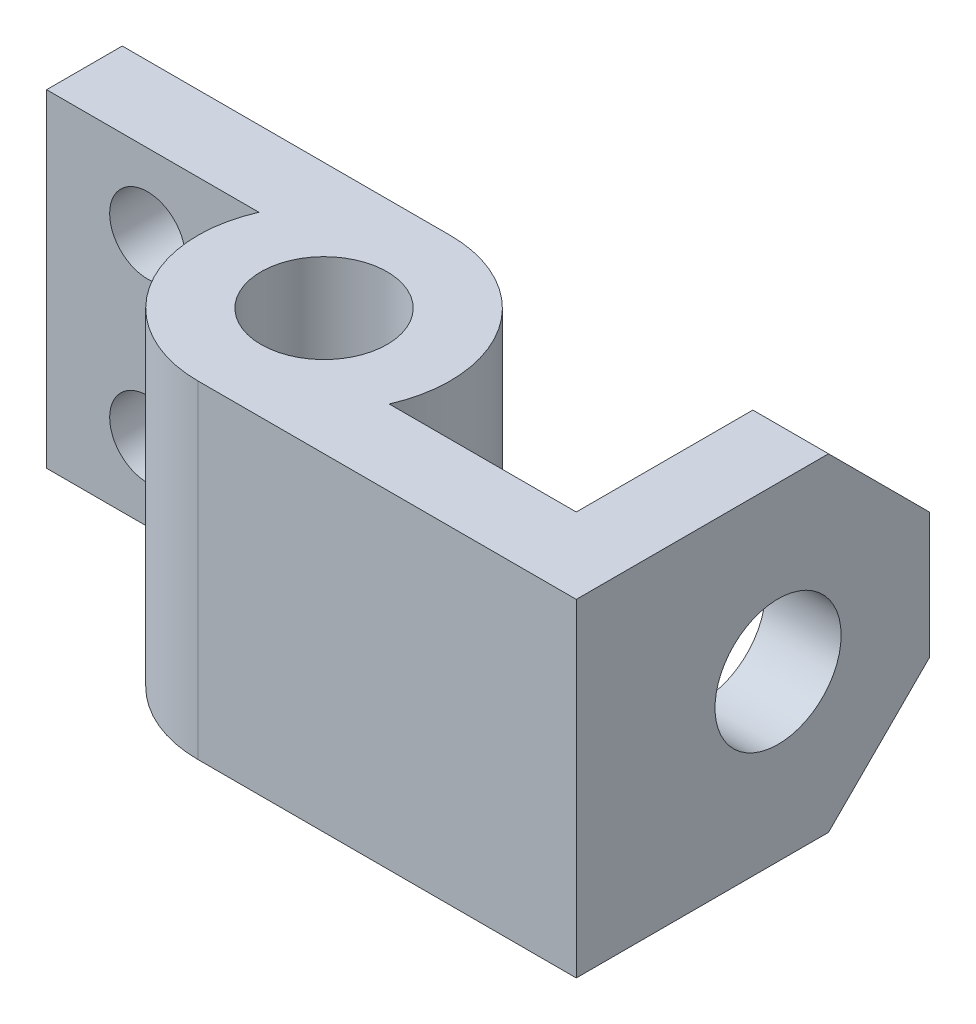
ISO-10303-21;
HEADER;
FILE_DESCRIPTION(('STEP AP214'),'2;1');
FILE_NAME('part.step','',(''),(''),'','','');
FILE_SCHEMA(('AUTOMOTIVE_DESIGN { 1 0 10303 214 1 1 1 1 }'));
ENDSEC;
DATA;
#1=APPLICATION_CONTEXT('core data for automotive mechanical design processes');
#2=APPLICATION_PROTOCOL_DEFINITION('international standard','automotive_design',2000,#1);
#3=PRODUCT_CONTEXT('',#1,'mechanical');
#4=PRODUCT('Part','Part','',(#3));
#5=PRODUCT_RELATED_PRODUCT_CATEGORY('part','',(#4));
#6=PRODUCT_DEFINITION_FORMATION('','',#4);
#7=PRODUCT_DEFINITION_CONTEXT('part definition',#1,'design');
#8=PRODUCT_DEFINITION('design','',#6,#7);
#9=PRODUCT_DEFINITION_SHAPE('','',#8);
#10=(LENGTH_UNIT() NAMED_UNIT(*) SI_UNIT(.MILLI.,.METRE.));
#11=(NAMED_UNIT(*) PLANE_ANGLE_UNIT() SI_UNIT($,.RADIAN.));
#12=(NAMED_UNIT(*) SI_UNIT($,.STERADIAN.) SOLID_ANGLE_UNIT());
#13=UNCERTAINTY_MEASURE_WITH_UNIT(LENGTH_MEASURE(1.E-05),#10,'distance_accuracy_value','');
#14=(GEOMETRIC_REPRESENTATION_CONTEXT(3) GLOBAL_UNCERTAINTY_ASSIGNED_CONTEXT((#13)) GLOBAL_UNIT_ASSIGNED_CONTEXT((#10,
#11,#12)) REPRESENTATION_CONTEXT('',''));
#15=CARTESIAN_POINT('',(0.,0.,0.));
#16=DIRECTION('',(0.,0.,1.));
#17=DIRECTION('',(1.,0.,0.));
#18=AXIS2_PLACEMENT_3D('',#15,#16,#17);
#19=CARTESIAN_POINT('',(0.,82.55,0.));
#20=DIRECTION('',(0.,1.,0.));
#21=DIRECTION('',(0.,0.,1.));
#22=AXIS2_PLACEMENT_3D('',#19,#20,#21);
#23=PLANE('',#22);
#24=DIRECTION('',(0.,0.,-1.));
#25=VECTOR('',#24,1.);
#26=CARTESIAN_POINT('',(95.25,82.55,31.75));
#27=LINE('',#26,#25);
#28=CARTESIAN_POINT('',(95.25,82.55,31.75));
#29=VERTEX_POINT('',#28);
#30=CARTESIAN_POINT('',(95.25,82.55,-31.75));
#31=VERTEX_POINT('',#30);
#32=EDGE_CURVE('E147',#29,#31,#27,.T.);
#33=ORIENTED_EDGE('',*,*,#32,.T.);
#34=DIRECTION('',(-1.,0.,0.));
#35=VECTOR('',#34,1.);
#36=CARTESIAN_POINT('',(76.2,82.55,-31.75));
#37=LINE('',#36,#35);
#38=CARTESIAN_POINT('',(76.2,82.55,-31.75));
#39=VERTEX_POINT('',#38);
#40=EDGE_CURVE('E164',#31,#39,#37,.T.);
#41=ORIENTED_EDGE('',*,*,#40,.T.);
#42=DIRECTION('',(0.,0.,1.));
#43=VECTOR('',#42,1.);
#44=CARTESIAN_POINT('',(76.2,82.55,-57.15));
#45=LINE('',#44,#43);
#46=CARTESIAN_POINT('',(76.2,82.55,12.7));
#47=VERTEX_POINT('',#46);
#48=EDGE_CURVE('E283',#39,#47,#45,.T.);
#49=ORIENTED_EDGE('',*,*,#48,.T.);
#50=DIRECTION('',(-1.,0.,0.));
#51=VECTOR('',#50,1.);
#52=CARTESIAN_POINT('',(76.2,82.55,12.7));
#53=LINE('',#52,#51);
#54=CARTESIAN_POINT('',(29.0993556629696,82.55,12.7));
#55=VERTEX_POINT('',#54);
#56=EDGE_CURVE('E280',#47,#55,#53,.T.);
#57=ORIENTED_EDGE('',*,*,#56,.T.);
#58=CARTESIAN_POINT('',(0.,82.55,0.));
#59=DIRECTION('',(0.,1.,0.));
#60=DIRECTION('',(0.,0.,1.));
#61=AXIS2_PLACEMENT_3D('',#58,#59,#60);
#62=CIRCLE('',#61,31.75);
#63=CARTESIAN_POINT('',(0.,82.55,-31.75));
#64=VERTEX_POINT('',#63);
#65=EDGE_CURVE('E277',#55,#64,#62,.T.);
#66=ORIENTED_EDGE('',*,*,#65,.T.);
#67=DIRECTION('',(-1.,0.,0.));
#68=VECTOR('',#67,1.);
#69=CARTESIAN_POINT('',(0.,82.55,-31.75));
#70=LINE('',#69,#68);
#71=CARTESIAN_POINT('',(-82.55,82.55,-31.75));
#72=VERTEX_POINT('',#71);
#73=EDGE_CURVE('E274',#64,#72,#70,.T.);
#74=ORIENTED_EDGE('',*,*,#73,.T.);
#75=DIRECTION('',(0.,0.,1.));
#76=VECTOR('',#75,1.);
#77=CARTESIAN_POINT('',(-82.55,82.55,-31.75));
#78=LINE('',#77,#76);
#79=CARTESIAN_POINT('',(-82.55,82.55,-12.7));
#80=VERTEX_POINT('',#79);
#81=EDGE_CURVE('E271',#72,#80,#78,.T.);
#82=ORIENTED_EDGE('',*,*,#81,.T.);
#83=DIRECTION('',(1.,0.,0.));
#84=VECTOR('',#83,1.);
#85=CARTESIAN_POINT('',(-82.55,82.55,-12.7));
#86=LINE('',#85,#84);
#87=CARTESIAN_POINT('',(-29.0993556629696,82.55,-12.7));
#88=VERTEX_POINT('',#87);
#89=EDGE_CURVE('E153',#80,#88,#86,.T.);
#90=ORIENTED_EDGE('',*,*,#89,.T.);
#91=CARTESIAN_POINT('',(0.,82.55,0.));
#92=DIRECTION('',(0.,1.,0.));
#93=DIRECTION('',(0.,0.,1.));
#94=AXIS2_PLACEMENT_3D('',#91,#92,#93);
#95=CIRCLE('',#94,31.75);
#96=CARTESIAN_POINT('',(3.32563597524808E-13,82.55,31.75));
#97=VERTEX_POINT('',#96);
#98=EDGE_CURVE('E148',#88,#97,#95,.T.);
#99=ORIENTED_EDGE('',*,*,#98,.T.);
#100=DIRECTION('',(1.,0.,0.));
#101=VECTOR('',#100,1.);
#102=CARTESIAN_POINT('',(3.32563597524808E-13,82.55,31.75));
#103=LINE('',#102,#101);
#104=EDGE_CURVE('E135',#97,#29,#103,.T.);
#105=ORIENTED_EDGE('',*,*,#104,.T.);
#106=EDGE_LOOP('',(#33,#41,#49,#57,#66,#74,#82,#90,#99,#105));
#107=FACE_BOUND('',#106,.T.);
#108=CARTESIAN_POINT('',(0.,82.55,0.));
#109=DIRECTION('',(0.,1.,0.));
#110=DIRECTION('',(0.,0.,1.));
#111=AXIS2_PLACEMENT_3D('',#108,#109,#110);
#112=CIRCLE('',#111,15.875);
#113=CARTESIAN_POINT('',(0.,82.55,15.875));
#114=VERTEX_POINT('',#113);
#115=EDGE_CURVE('E268',#114,#114,#112,.T.);
#116=ORIENTED_EDGE('',*,*,#115,.F.);
#117=EDGE_LOOP('',(#116));
#118=FACE_BOUND('',#117,.T.);
#119=ADVANCED_FACE('F45',(#107,#118),#23,.T.);
#120=CARTESIAN_POINT('',(0.,0.,0.));
#121=DIRECTION('',(0.,1.,0.));
#122=DIRECTION('',(0.,0.,1.));
#123=AXIS2_PLACEMENT_3D('',#120,#121,#122);
#124=PLANE('',#123);
#125=DIRECTION('',(0.,0.,1.));
#126=VECTOR('',#125,1.);
#127=CARTESIAN_POINT('',(76.2,0.,-57.15));
#128=LINE('',#127,#126);
#129=CARTESIAN_POINT('',(76.2,0.,-31.7499999999999));
#130=VERTEX_POINT('',#129);
#131=CARTESIAN_POINT('',(76.2,0.,12.7));
#132=VERTEX_POINT('',#131);
#133=EDGE_CURVE('E257',#130,#132,#128,.T.);
#134=ORIENTED_EDGE('',*,*,#133,.F.);
#135=DIRECTION('',(1.,0.,0.));
#136=VECTOR('',#135,1.);
#137=CARTESIAN_POINT('',(0.,0.,-31.7499999999999));
#138=LINE('',#137,#136);
#139=CARTESIAN_POINT('',(95.25,0.,-31.7499999999999));
#140=VERTEX_POINT('',#139);
#141=EDGE_CURVE('E55',#130,#140,#138,.T.);
#142=ORIENTED_EDGE('',*,*,#141,.T.);
#143=DIRECTION('',(0.,0.,-1.));
#144=VECTOR('',#143,1.);
#145=CARTESIAN_POINT('',(95.25,0.,31.75));
#146=LINE('',#145,#144);
#147=CARTESIAN_POINT('',(95.25,0.,31.75));
#148=VERTEX_POINT('',#147);
#149=EDGE_CURVE('E260',#148,#140,#146,.T.);
#150=ORIENTED_EDGE('',*,*,#149,.F.);
#151=DIRECTION('',(1.,0.,0.));
#152=VECTOR('',#151,1.);
#153=CARTESIAN_POINT('',(3.32563597524808E-13,0.,31.75));
#154=LINE('',#153,#152);
#155=CARTESIAN_POINT('',(3.32563597524808E-13,0.,31.75));
#156=VERTEX_POINT('',#155);
#157=EDGE_CURVE('E263',#156,#148,#154,.T.);
#158=ORIENTED_EDGE('',*,*,#157,.F.);
#159=CARTESIAN_POINT('',(0.,0.,0.));
#160=DIRECTION('',(0.,1.,0.));
#161=DIRECTION('',(0.,0.,1.));
#162=AXIS2_PLACEMENT_3D('',#159,#160,#161);
#163=CIRCLE('',#162,31.75);
#164=CARTESIAN_POINT('',(-29.0993556629696,0.,-12.7));
#165=VERTEX_POINT('',#164);
#166=EDGE_CURVE('E162',#165,#156,#163,.T.);
#167=ORIENTED_EDGE('',*,*,#166,.F.);
#168=DIRECTION('',(1.,0.,0.));
#169=VECTOR('',#168,1.);
#170=CARTESIAN_POINT('',(-82.55,0.,-12.7));
#171=LINE('',#170,#169);
#172=CARTESIAN_POINT('',(-82.55,0.,-12.7));
#173=VERTEX_POINT('',#172);
#174=EDGE_CURVE('E158',#173,#165,#171,.T.);
#175=ORIENTED_EDGE('',*,*,#174,.F.);
#176=DIRECTION('',(0.,0.,1.));
#177=VECTOR('',#176,1.);
#178=CARTESIAN_POINT('',(-82.55,0.,-31.75));
#179=LINE('',#178,#177);
#180=CARTESIAN_POINT('',(-82.55,0.,-31.75));
#181=VERTEX_POINT('',#180);
#182=EDGE_CURVE('E245',#181,#173,#179,.T.);
#183=ORIENTED_EDGE('',*,*,#182,.F.);
#184=DIRECTION('',(-1.,0.,0.));
#185=VECTOR('',#184,1.);
#186=CARTESIAN_POINT('',(0.,0.,-31.75));
#187=LINE('',#186,#185);
#188=CARTESIAN_POINT('',(0.,0.,-31.75));
#189=VERTEX_POINT('',#188);
#190=EDGE_CURVE('E248',#189,#181,#187,.T.);
#191=ORIENTED_EDGE('',*,*,#190,.F.);
#192=CARTESIAN_POINT('',(0.,0.,0.));
#193=DIRECTION('',(0.,1.,0.));
#194=DIRECTION('',(0.,0.,1.));
#195=AXIS2_PLACEMENT_3D('',#192,#193,#194);
#196=CIRCLE('',#195,31.75);
#197=CARTESIAN_POINT('',(29.0993556629696,0.,12.7));
#198=VERTEX_POINT('',#197);
#199=EDGE_CURVE('E251',#198,#189,#196,.T.);
#200=ORIENTED_EDGE('',*,*,#199,.F.);
#201=DIRECTION('',(-1.,0.,0.));
#202=VECTOR('',#201,1.);
#203=CARTESIAN_POINT('',(76.2,0.,12.7));
#204=LINE('',#203,#202);
#205=EDGE_CURVE('E254',#132,#198,#204,.T.);
#206=ORIENTED_EDGE('',*,*,#205,.F.);
#207=EDGE_LOOP('',(#134,#142,#150,#158,#167,#175,#183,#191,#200,#206));
#208=FACE_BOUND('',#207,.T.);
#209=CARTESIAN_POINT('',(0.,0.,0.));
#210=DIRECTION('',(0.,1.,0.));
#211=DIRECTION('',(0.,0.,1.));
#212=AXIS2_PLACEMENT_3D('',#209,#210,#211);
#213=CIRCLE('',#212,15.875);
#214=CARTESIAN_POINT('',(0.,0.,15.875));
#215=VERTEX_POINT('',#214);
#216=EDGE_CURVE('E179',#215,#215,#213,.T.);
#217=ORIENTED_EDGE('',*,*,#216,.T.);
#218=EDGE_LOOP('',(#217));
#219=FACE_BOUND('',#218,.T.);
#220=ADVANCED_FACE('F326',(#208,#219),#124,.F.);
#221=CARTESIAN_POINT('',(0.,82.55,0.));
#222=DIRECTION('',(0.,-1.,0.));
#223=DIRECTION('',(0.,0.,-1.));
#224=AXIS2_PLACEMENT_3D('',#221,#222,#223);
#225=CYLINDRICAL_SURFACE('',#224,31.75);
#226=ORIENTED_EDGE('',*,*,#166,.T.);
#227=DIRECTION('',(0.,-1.,0.));
#228=VECTOR('',#227,1.);
#229=CARTESIAN_POINT('',(3.32563597524808E-13,82.55,31.75));
#230=LINE('',#229,#228);
#231=EDGE_CURVE('E139',#97,#156,#230,.T.);
#232=ORIENTED_EDGE('',*,*,#231,.F.);
#233=ORIENTED_EDGE('',*,*,#98,.F.);
#234=DIRECTION('',(0.,-1.,0.));
#235=VECTOR('',#234,1.);
#236=CARTESIAN_POINT('',(-29.0993556629696,82.55,-12.7));
#237=LINE('',#236,#235);
#238=EDGE_CURVE('E240',#88,#165,#237,.T.);
#239=ORIENTED_EDGE('',*,*,#238,.T.);
#240=EDGE_LOOP('',(#226,#232,#233,#239));
#241=FACE_BOUND('',#240,.T.);
#242=ADVANCED_FACE('F160',(#241),#225,.T.);
#243=CARTESIAN_POINT('',(3.32563597524808E-13,82.55,31.75));
#244=DIRECTION('',(0.,0.,-1.));
#245=DIRECTION('',(-1.,0.,0.));
#246=AXIS2_PLACEMENT_3D('',#243,#244,#245);
#247=PLANE('',#246);
#248=ORIENTED_EDGE('',*,*,#157,.T.);
#249=DIRECTION('',(0.,-1.,0.));
#250=VECTOR('',#249,1.);
#251=CARTESIAN_POINT('',(95.25,82.55,31.75));
#252=LINE('',#251,#250);
#253=EDGE_CURVE('E142',#29,#148,#252,.T.);
#254=ORIENTED_EDGE('',*,*,#253,.F.);
#255=ORIENTED_EDGE('',*,*,#104,.F.);
#256=ORIENTED_EDGE('',*,*,#231,.T.);
#257=EDGE_LOOP('',(#248,#254,#255,#256));
#258=FACE_BOUND('',#257,.T.);
#259=ADVANCED_FACE('F137',(#258),#247,.F.);
#260=CARTESIAN_POINT('',(95.25,82.55,31.75));
#261=DIRECTION('',(-1.,0.,0.));
#262=DIRECTION('',(0.,0.,1.));
#263=AXIS2_PLACEMENT_3D('',#260,#261,#262);
#264=PLANE('',#263);
#265=CARTESIAN_POINT('',(95.25,41.402,-19.05));
#266=DIRECTION('',(1.,0.,0.));
#267=DIRECTION('',(0.,0.,-1.));
#268=AXIS2_PLACEMENT_3D('',#265,#266,#267);
#269=CIRCLE('',#268,15.875);
#270=CARTESIAN_POINT('',(95.25,41.402,-34.925));
#271=VERTEX_POINT('',#270);
#272=EDGE_CURVE('E180',#271,#271,#269,.T.);
#273=ORIENTED_EDGE('',*,*,#272,.F.);
#274=EDGE_LOOP('',(#273));
#275=FACE_BOUND('',#274,.T.);
#276=ORIENTED_EDGE('',*,*,#149,.T.);
#277=DIRECTION('',(0.,-0.707106781186546,0.707106781186549));
#278=VECTOR('',#277,1.);
#279=CARTESIAN_POINT('',(95.25,25.4,-57.15));
#280=LINE('',#279,#278);
#281=CARTESIAN_POINT('',(95.25,25.4,-57.15));
#282=VERTEX_POINT('',#281);
#283=EDGE_CURVE('E11',#140,#282,#280,.F.);
#284=ORIENTED_EDGE('',*,*,#283,.T.);
#285=DIRECTION('',(0.,-1.,0.));
#286=VECTOR('',#285,1.);
#287=CARTESIAN_POINT('',(95.25,82.55,-57.15));
#288=LINE('',#287,#286);
#289=CARTESIAN_POINT('',(95.25,57.1499999999999,-57.15));
#290=VERTEX_POINT('',#289);
#291=EDGE_CURVE('E171',#290,#282,#288,.T.);
#292=ORIENTED_EDGE('',*,*,#291,.F.);
#293=DIRECTION('',(0.,0.707106781186549,0.707106781186546));
#294=VECTOR('',#293,1.);
#295=CARTESIAN_POINT('',(95.25,82.55,-31.75));
#296=LINE('',#295,#294);
#297=EDGE_CURVE('E195',#290,#31,#296,.T.);
#298=ORIENTED_EDGE('',*,*,#297,.T.);
#299=ORIENTED_EDGE('',*,*,#32,.F.);
#300=ORIENTED_EDGE('',*,*,#253,.T.);
#301=EDGE_LOOP('',(#276,#284,#292,#298,#299,#300));
#302=FACE_BOUND('',#301,.T.);
#303=ADVANCED_FACE('F375',(#275,#302),#264,.F.);
#304=CARTESIAN_POINT('',(95.25,82.55,-57.15));
#305=DIRECTION('',(0.,0.,1.));
#306=DIRECTION('',(1.,0.,0.));
#307=AXIS2_PLACEMENT_3D('',#304,#305,#306);
#308=PLANE('',#307);
#309=ORIENTED_EDGE('',*,*,#291,.T.);
#310=DIRECTION('',(-1.,0.,0.));
#311=VECTOR('',#310,1.);
#312=CARTESIAN_POINT('',(95.25,25.4,-57.15));
#313=LINE('',#312,#311);
#314=CARTESIAN_POINT('',(76.2,25.4,-57.15));
#315=VERTEX_POINT('',#314);
#316=EDGE_CURVE('E198',#282,#315,#313,.T.);
#317=ORIENTED_EDGE('',*,*,#316,.T.);
#318=DIRECTION('',(0.,-1.,0.));
#319=VECTOR('',#318,1.);
#320=CARTESIAN_POINT('',(76.2,82.55,-57.15));
#321=LINE('',#320,#319);
#322=CARTESIAN_POINT('',(76.2,57.1499999999999,-57.15));
#323=VERTEX_POINT('',#322);
#324=EDGE_CURVE('E209',#323,#315,#321,.T.);
#325=ORIENTED_EDGE('',*,*,#324,.F.);
#326=DIRECTION('',(1.,0.,0.));
#327=VECTOR('',#326,1.);
#328=CARTESIAN_POINT('',(95.25,57.1499999999999,-57.15));
#329=LINE('',#328,#327);
#330=EDGE_CURVE('E192',#323,#290,#329,.T.);
#331=ORIENTED_EDGE('',*,*,#330,.T.);
#332=EDGE_LOOP('',(#309,#317,#325,#331));
#333=FACE_BOUND('',#332,.T.);
#334=ADVANCED_FACE('F208',(#333),#308,.F.);
#335=CARTESIAN_POINT('',(76.2,82.55,-57.15));
#336=DIRECTION('',(1.,0.,0.));
#337=DIRECTION('',(0.,0.,-1.));
#338=AXIS2_PLACEMENT_3D('',#335,#336,#337);
#339=PLANE('',#338);
#340=CARTESIAN_POINT('',(76.2,41.402,-19.05));
#341=DIRECTION('',(1.,0.,0.));
#342=DIRECTION('',(0.,0.,-1.));
#343=AXIS2_PLACEMENT_3D('',#340,#341,#342);
#344=CIRCLE('',#343,15.875);
#345=CARTESIAN_POINT('',(76.2,41.402,-34.925));
#346=VERTEX_POINT('',#345);
#347=EDGE_CURVE('E175',#346,#346,#344,.T.);
#348=ORIENTED_EDGE('',*,*,#347,.T.);
#349=EDGE_LOOP('',(#348));
#350=FACE_BOUND('',#349,.T.);
#351=ORIENTED_EDGE('',*,*,#324,.T.);
#352=DIRECTION('',(0.,0.707106781186546,-0.707106781186549));
#353=VECTOR('',#352,1.);
#354=CARTESIAN_POINT('',(76.2,25.4,-57.15));
#355=LINE('',#354,#353);
#356=EDGE_CURVE('E69',#315,#130,#355,.F.);
#357=ORIENTED_EDGE('',*,*,#356,.T.);
#358=ORIENTED_EDGE('',*,*,#133,.T.);
#359=DIRECTION('',(0.,-1.,0.));
#360=VECTOR('',#359,1.);
#361=CARTESIAN_POINT('',(76.2,82.55,12.7));
#362=LINE('',#361,#360);
#363=EDGE_CURVE('E217',#47,#132,#362,.T.);
#364=ORIENTED_EDGE('',*,*,#363,.F.);
#365=ORIENTED_EDGE('',*,*,#48,.F.);
#366=DIRECTION('',(0.,-0.707106781186549,-0.707106781186546));
#367=VECTOR('',#366,1.);
#368=CARTESIAN_POINT('',(76.2,82.55,-31.75));
#369=LINE('',#368,#367);
#370=EDGE_CURVE('E169',#39,#323,#369,.T.);
#371=ORIENTED_EDGE('',*,*,#370,.T.);
#372=EDGE_LOOP('',(#351,#357,#358,#364,#365,#371));
#373=FACE_BOUND('',#372,.T.);
#374=ADVANCED_FACE('F214',(#350,#373),#339,.F.);
#375=CARTESIAN_POINT('',(76.2,82.55,12.7));
#376=DIRECTION('',(0.,0.,1.));
#377=DIRECTION('',(1.,0.,0.));
#378=AXIS2_PLACEMENT_3D('',#375,#376,#377);
#379=PLANE('',#378);
#380=ORIENTED_EDGE('',*,*,#205,.T.);
#381=DIRECTION('',(0.,-1.,0.));
#382=VECTOR('',#381,1.);
#383=CARTESIAN_POINT('',(29.0993556629696,82.55,12.7));
#384=LINE('',#383,#382);
#385=EDGE_CURVE('E222',#55,#198,#384,.T.);
#386=ORIENTED_EDGE('',*,*,#385,.F.);
#387=ORIENTED_EDGE('',*,*,#56,.F.);
#388=ORIENTED_EDGE('',*,*,#363,.T.);
#389=EDGE_LOOP('',(#380,#386,#387,#388));
#390=FACE_BOUND('',#389,.T.);
#391=ADVANCED_FACE('F383',(#390),#379,.F.);
#392=CARTESIAN_POINT('',(0.,82.55,0.));
#393=DIRECTION('',(0.,-1.,0.));
#394=DIRECTION('',(0.,0.,-1.));
#395=AXIS2_PLACEMENT_3D('',#392,#393,#394);
#396=CYLINDRICAL_SURFACE('',#395,31.75);
#397=ORIENTED_EDGE('',*,*,#199,.T.);
#398=DIRECTION('',(0.,-1.,0.));
#399=VECTOR('',#398,1.);
#400=CARTESIAN_POINT('',(0.,82.55,-31.75));
#401=LINE('',#400,#399);
#402=EDGE_CURVE('E228',#64,#189,#401,.T.);
#403=ORIENTED_EDGE('',*,*,#402,.F.);
#404=ORIENTED_EDGE('',*,*,#65,.F.);
#405=ORIENTED_EDGE('',*,*,#385,.T.);
#406=EDGE_LOOP('',(#397,#403,#404,#405));
#407=FACE_BOUND('',#406,.T.);
#408=ADVANCED_FACE('F312',(#407),#396,.T.);
#409=CARTESIAN_POINT('',(0.,82.55,-31.75));
#410=DIRECTION('',(0.,0.,1.));
#411=DIRECTION('',(1.,0.,0.));
#412=AXIS2_PLACEMENT_3D('',#409,#410,#411);
#413=PLANE('',#412);
#414=CARTESIAN_POINT('',(-57.15,63.5,-31.75));
#415=DIRECTION('',(0.,0.,-1.));
#416=DIRECTION('',(-1.,0.,0.));
#417=AXIS2_PLACEMENT_3D('',#414,#415,#416);
#418=CIRCLE('',#417,9.525);
#419=CARTESIAN_POINT('',(-66.675,63.5,-31.75));
#420=VERTEX_POINT('',#419);
#421=EDGE_CURVE('E186',#420,#420,#418,.T.);
#422=ORIENTED_EDGE('',*,*,#421,.F.);
#423=EDGE_LOOP('',(#422));
#424=FACE_BOUND('',#423,.T.);
#425=CARTESIAN_POINT('',(-57.15,19.05,-31.75));
#426=DIRECTION('',(0.,0.,-1.));
#427=DIRECTION('',(-1.,0.,0.));
#428=AXIS2_PLACEMENT_3D('',#425,#426,#427);
#429=CIRCLE('',#428,9.525);
#430=CARTESIAN_POINT('',(-66.675,19.05,-31.75));
#431=VERTEX_POINT('',#430);
#432=EDGE_CURVE('E297',#431,#431,#429,.T.);
#433=ORIENTED_EDGE('',*,*,#432,.F.);
#434=EDGE_LOOP('',(#433));
#435=FACE_BOUND('',#434,.T.);
#436=ORIENTED_EDGE('',*,*,#190,.T.);
#437=DIRECTION('',(0.,-1.,0.));
#438=VECTOR('',#437,1.);
#439=CARTESIAN_POINT('',(-82.55,82.55,-31.75));
#440=LINE('',#439,#438);
#441=EDGE_CURVE('E232',#72,#181,#440,.T.);
#442=ORIENTED_EDGE('',*,*,#441,.F.);
#443=ORIENTED_EDGE('',*,*,#73,.F.);
#444=ORIENTED_EDGE('',*,*,#402,.T.);
#445=EDGE_LOOP('',(#436,#442,#443,#444));
#446=FACE_BOUND('',#445,.T.);
#447=ADVANCED_FACE('F308',(#424,#435,#446),#413,.F.);
#448=CARTESIAN_POINT('',(-82.55,82.55,-31.75));
#449=DIRECTION('',(1.,0.,0.));
#450=DIRECTION('',(0.,0.,-1.));
#451=AXIS2_PLACEMENT_3D('',#448,#449,#450);
#452=PLANE('',#451);
#453=ORIENTED_EDGE('',*,*,#182,.T.);
#454=DIRECTION('',(0.,-1.,0.));
#455=VECTOR('',#454,1.);
#456=CARTESIAN_POINT('',(-82.55,82.55,-12.7));
#457=LINE('',#456,#455);
#458=EDGE_CURVE('E236',#80,#173,#457,.T.);
#459=ORIENTED_EDGE('',*,*,#458,.F.);
#460=ORIENTED_EDGE('',*,*,#81,.F.);
#461=ORIENTED_EDGE('',*,*,#441,.T.);
#462=EDGE_LOOP('',(#453,#459,#460,#461));
#463=FACE_BOUND('',#462,.T.);
#464=ADVANCED_FACE('F311',(#463),#452,.F.);
#465=CARTESIAN_POINT('',(-82.55,82.55,-12.7));
#466=DIRECTION('',(0.,0.,-1.));
#467=DIRECTION('',(-1.,0.,0.));
#468=AXIS2_PLACEMENT_3D('',#465,#466,#467);
#469=PLANE('',#468);
#470=CARTESIAN_POINT('',(-57.15,63.5,-12.7));
#471=DIRECTION('',(0.,0.,-1.));
#472=DIRECTION('',(-1.,0.,0.));
#473=AXIS2_PLACEMENT_3D('',#470,#471,#472);
#474=CIRCLE('',#473,9.525);
#475=CARTESIAN_POINT('',(-66.675,63.5,-12.7));
#476=VERTEX_POINT('',#475);
#477=EDGE_CURVE('E185',#476,#476,#474,.T.);
#478=ORIENTED_EDGE('',*,*,#477,.T.);
#479=EDGE_LOOP('',(#478));
#480=FACE_BOUND('',#479,.T.);
#481=CARTESIAN_POINT('',(-57.15,19.05,-12.7));
#482=DIRECTION('',(0.,0.,-1.));
#483=DIRECTION('',(-1.,0.,0.));
#484=AXIS2_PLACEMENT_3D('',#481,#482,#483);
#485=CIRCLE('',#484,9.525);
#486=CARTESIAN_POINT('',(-66.675,19.05,-12.7));
#487=VERTEX_POINT('',#486);
#488=EDGE_CURVE('E181',#487,#487,#485,.T.);
#489=ORIENTED_EDGE('',*,*,#488,.T.);
#490=EDGE_LOOP('',(#489));
#491=FACE_BOUND('',#490,.T.);
#492=ORIENTED_EDGE('',*,*,#174,.T.);
#493=ORIENTED_EDGE('',*,*,#238,.F.);
#494=ORIENTED_EDGE('',*,*,#89,.F.);
#495=ORIENTED_EDGE('',*,*,#458,.T.);
#496=EDGE_LOOP('',(#492,#493,#494,#495));
#497=FACE_BOUND('',#496,.T.);
#498=ADVANCED_FACE('F329',(#480,#491,#497),#469,.F.);
#499=CARTESIAN_POINT('',(0.,82.55,0.));
#500=DIRECTION('',(0.,-1.,0.));
#501=DIRECTION('',(0.,0.,-1.));
#502=AXIS2_PLACEMENT_3D('',#499,#500,#501);
#503=CYLINDRICAL_SURFACE('',#502,15.875);
#504=ORIENTED_EDGE('',*,*,#115,.T.);
#505=EDGE_LOOP('',(#504));
#506=FACE_BOUND('',#505,.T.);
#507=ORIENTED_EDGE('',*,*,#216,.F.);
#508=EDGE_LOOP('',(#507));
#509=FACE_BOUND('',#508,.T.);
#510=ADVANCED_FACE('F331',(#506,#509),#503,.F.);
#511=CARTESIAN_POINT('',(53.8479999999999,41.402,-19.05));
#512=DIRECTION('',(1.,0.,0.));
#513=DIRECTION('',(0.,0.,-1.));
#514=AXIS2_PLACEMENT_3D('',#511,#512,#513);
#515=CYLINDRICAL_SURFACE('',#514,15.875);
#516=ORIENTED_EDGE('',*,*,#272,.T.);
#517=EDGE_LOOP('',(#516));
#518=FACE_BOUND('',#517,.T.);
#519=ORIENTED_EDGE('',*,*,#347,.F.);
#520=EDGE_LOOP('',(#519));
#521=FACE_BOUND('',#520,.T.);
#522=ADVANCED_FACE('F338',(#518,#521),#515,.F.);
#523=CARTESIAN_POINT('',(-57.15,19.05,9.65200000000006));
#524=DIRECTION('',(0.,0.,-1.));
#525=DIRECTION('',(-1.,0.,0.));
#526=AXIS2_PLACEMENT_3D('',#523,#524,#525);
#527=CYLINDRICAL_SURFACE('',#526,9.525);
#528=ORIENTED_EDGE('',*,*,#432,.T.);
#529=EDGE_LOOP('',(#528));
#530=FACE_BOUND('',#529,.T.);
#531=ORIENTED_EDGE('',*,*,#488,.F.);
#532=EDGE_LOOP('',(#531));
#533=FACE_BOUND('',#532,.T.);
#534=ADVANCED_FACE('F352',(#530,#533),#527,.F.);
#535=CARTESIAN_POINT('',(-57.15,63.5,9.65200000000006));
#536=DIRECTION('',(0.,0.,-1.));
#537=DIRECTION('',(-1.,0.,0.));
#538=AXIS2_PLACEMENT_3D('',#535,#536,#537);
#539=CYLINDRICAL_SURFACE('',#538,9.525);
#540=ORIENTED_EDGE('',*,*,#421,.T.);
#541=EDGE_LOOP('',(#540));
#542=FACE_BOUND('',#541,.T.);
#543=ORIENTED_EDGE('',*,*,#477,.F.);
#544=EDGE_LOOP('',(#543));
#545=FACE_BOUND('',#544,.T.);
#546=ADVANCED_FACE('F305',(#542,#545),#539,.F.);
#547=CARTESIAN_POINT('',(0.,82.55,-31.75));
#548=DIRECTION('',(0.,0.707106781186546,-0.707106781186549));
#549=DIRECTION('',(1.,0.,0.));
#550=AXIS2_PLACEMENT_3D('',#547,#548,#549);
#551=PLANE('',#550);
#552=ORIENTED_EDGE('',*,*,#297,.F.);
#553=ORIENTED_EDGE('',*,*,#330,.F.);
#554=ORIENTED_EDGE('',*,*,#370,.F.);
#555=ORIENTED_EDGE('',*,*,#40,.F.);
#556=EDGE_LOOP('',(#552,#553,#554,#555));
#557=FACE_BOUND('',#556,.T.);
#558=ADVANCED_FACE('F358',(#557),#551,.T.);
#559=CARTESIAN_POINT('',(95.25,25.4,-57.15));
#560=DIRECTION('',(0.,0.707106781186549,0.707106781186546));
#561=DIRECTION('',(-1.,0.,0.));
#562=AXIS2_PLACEMENT_3D('',#559,#560,#561);
#563=PLANE('',#562);
#564=ORIENTED_EDGE('',*,*,#283,.F.);
#565=ORIENTED_EDGE('',*,*,#141,.F.);
#566=ORIENTED_EDGE('',*,*,#356,.F.);
#567=ORIENTED_EDGE('',*,*,#316,.F.);
#568=EDGE_LOOP('',(#564,#565,#566,#567));
#569=FACE_BOUND('',#568,.T.);
#570=ADVANCED_FACE('F48',(#569),#563,.F.);
#571=CLOSED_SHELL('',(#119,#220,#242,#259,#303,#334,#374,#391,#408,#447,#464,#498,#510,#522,
#534,#546,#558,#570));
#572=MANIFOLD_SOLID_BREP('B2',#571);
#573=ADVANCED_BREP_SHAPE_REPRESENTATION('',(#18,#572),#14);
#574=SHAPE_DEFINITION_REPRESENTATION(#9,#573);
ENDSEC;
END-ISO-10303-21;
